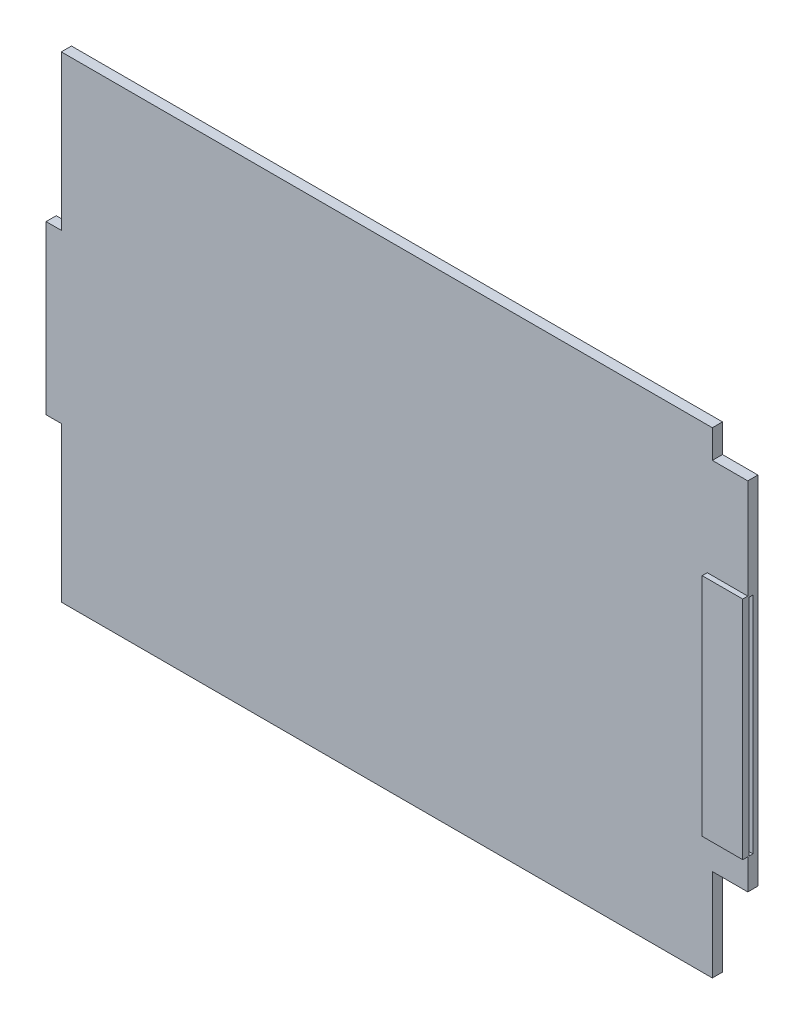
ISO-10303-21;
HEADER;
FILE_DESCRIPTION(('STEP AP214'),'2;1');
FILE_NAME('part.step','',(''),(''),'','','');
FILE_SCHEMA(('AUTOMOTIVE_DESIGN { 1 0 10303 214 1 1 1 1 }'));
ENDSEC;
DATA;
#1=APPLICATION_CONTEXT('core data for automotive mechanical design processes');
#2=APPLICATION_PROTOCOL_DEFINITION('international standard','automotive_design',2000,#1);
#3=PRODUCT_CONTEXT('',#1,'mechanical');
#4=PRODUCT('Part','Part','',(#3));
#5=PRODUCT_RELATED_PRODUCT_CATEGORY('part','',(#4));
#6=PRODUCT_DEFINITION_FORMATION('','',#4);
#7=PRODUCT_DEFINITION_CONTEXT('part definition',#1,'design');
#8=PRODUCT_DEFINITION('design','',#6,#7);
#9=PRODUCT_DEFINITION_SHAPE('','',#8);
#10=(LENGTH_UNIT() NAMED_UNIT(*) SI_UNIT(.MILLI.,.METRE.));
#11=(NAMED_UNIT(*) PLANE_ANGLE_UNIT() SI_UNIT($,.RADIAN.));
#12=(NAMED_UNIT(*) SI_UNIT($,.STERADIAN.) SOLID_ANGLE_UNIT());
#13=UNCERTAINTY_MEASURE_WITH_UNIT(LENGTH_MEASURE(1.E-05),#10,'distance_accuracy_value','');
#14=(GEOMETRIC_REPRESENTATION_CONTEXT(3) GLOBAL_UNCERTAINTY_ASSIGNED_CONTEXT((#13)) GLOBAL_UNIT_ASSIGNED_CONTEXT((#10,
#11,#12)) REPRESENTATION_CONTEXT('',''));
#15=CARTESIAN_POINT('',(0.,0.,0.));
#16=DIRECTION('',(0.,0.,1.));
#17=DIRECTION('',(1.,0.,0.));
#18=AXIS2_PLACEMENT_3D('',#15,#16,#17);
#19=CARTESIAN_POINT('',(-34.6,8.25220683677559,1.));
#20=DIRECTION('',(1.,0.,0.));
#21=DIRECTION('',(0.,0.,-1.));
#22=AXIS2_PLACEMENT_3D('',#19,#20,#21);
#23=PLANE('',#22);
#24=DIRECTION('',(0.,-1.,0.));
#25=VECTOR('',#24,1.);
#26=CARTESIAN_POINT('',(-34.6,8.25220683677559,0.));
#27=LINE('',#26,#25);
#28=CARTESIAN_POINT('',(-34.6,8.25220683677559,0.));
#29=VERTEX_POINT('',#28);
#30=CARTESIAN_POINT('',(-34.6,-8.24779316322441,0.));
#31=VERTEX_POINT('',#30);
#32=EDGE_CURVE('E168',#29,#31,#27,.T.);
#33=ORIENTED_EDGE('',*,*,#32,.T.);
#34=DIRECTION('',(0.,0.,-1.));
#35=VECTOR('',#34,1.);
#36=CARTESIAN_POINT('',(-34.6,-8.24779316322441,1.));
#37=LINE('',#36,#35);
#38=CARTESIAN_POINT('',(-34.6,-8.24779316322441,1.));
#39=VERTEX_POINT('',#38);
#40=EDGE_CURVE('E217',#39,#31,#37,.T.);
#41=ORIENTED_EDGE('',*,*,#40,.F.);
#42=DIRECTION('',(0.,-1.,0.));
#43=VECTOR('',#42,1.);
#44=CARTESIAN_POINT('',(-34.6,8.25220683677559,1.));
#45=LINE('',#44,#43);
#46=CARTESIAN_POINT('',(-34.6,8.25220683677559,1.));
#47=VERTEX_POINT('',#46);
#48=EDGE_CURVE('E192',#47,#39,#45,.T.);
#49=ORIENTED_EDGE('',*,*,#48,.F.);
#50=DIRECTION('',(0.,0.,-1.));
#51=VECTOR('',#50,1.);
#52=CARTESIAN_POINT('',(-34.6,8.25220683677559,1.));
#53=LINE('',#52,#51);
#54=EDGE_CURVE('E164',#47,#29,#53,.T.);
#55=ORIENTED_EDGE('',*,*,#54,.T.);
#56=EDGE_LOOP('',(#33,#41,#49,#55));
#57=FACE_BOUND('',#56,.T.);
#58=ADVANCED_FACE('F35',(#57),#23,.F.);
#59=CARTESIAN_POINT('',(-34.6,-8.24779316322441,1.));
#60=DIRECTION('',(0.,1.,0.));
#61=DIRECTION('',(-1.,0.,0.));
#62=AXIS2_PLACEMENT_3D('',#59,#60,#61);
#63=PLANE('',#62);
#64=DIRECTION('',(1.,0.,0.));
#65=VECTOR('',#64,1.);
#66=CARTESIAN_POINT('',(-34.6,-8.24779316322441,0.));
#67=LINE('',#66,#65);
#68=CARTESIAN_POINT('',(-33.0953892850898,-8.24779316322442,0.));
#69=VERTEX_POINT('',#68);
#70=EDGE_CURVE('E171',#31,#69,#67,.T.);
#71=ORIENTED_EDGE('',*,*,#70,.T.);
#72=DIRECTION('',(0.,0.,-1.));
#73=VECTOR('',#72,1.);
#74=CARTESIAN_POINT('',(-33.0953892850898,-8.24779316322442,1.));
#75=LINE('',#74,#73);
#76=CARTESIAN_POINT('',(-33.0953892850898,-8.24779316322442,1.));
#77=VERTEX_POINT('',#76);
#78=EDGE_CURVE('E214',#77,#69,#75,.T.);
#79=ORIENTED_EDGE('',*,*,#78,.F.);
#80=DIRECTION('',(1.,0.,0.));
#81=VECTOR('',#80,1.);
#82=CARTESIAN_POINT('',(-34.6,-8.24779316322441,1.));
#83=LINE('',#82,#81);
#84=EDGE_CURVE('E111',#39,#77,#83,.T.);
#85=ORIENTED_EDGE('',*,*,#84,.F.);
#86=ORIENTED_EDGE('',*,*,#40,.T.);
#87=EDGE_LOOP('',(#71,#79,#85,#86));
#88=FACE_BOUND('',#87,.T.);
#89=ADVANCED_FACE('F282',(#88),#63,.F.);
#90=CARTESIAN_POINT('',(-33.0953892850898,-8.24779316322442,1.));
#91=DIRECTION('',(1.,0.,0.));
#92=DIRECTION('',(0.,0.,-1.));
#93=AXIS2_PLACEMENT_3D('',#90,#91,#92);
#94=PLANE('',#93);
#95=DIRECTION('',(0.,-1.,0.));
#96=VECTOR('',#95,1.);
#97=CARTESIAN_POINT('',(-33.0953892850898,-8.24779316322442,0.));
#98=LINE('',#97,#96);
#99=CARTESIAN_POINT('',(-33.0953892850898,-23.4977931632244,0.));
#100=VERTEX_POINT('',#99);
#101=EDGE_CURVE('E174',#69,#100,#98,.T.);
#102=ORIENTED_EDGE('',*,*,#101,.T.);
#103=DIRECTION('',(0.,0.,-1.));
#104=VECTOR('',#103,1.);
#105=CARTESIAN_POINT('',(-33.0953892850898,-23.4977931632244,1.));
#106=LINE('',#105,#104);
#107=CARTESIAN_POINT('',(-33.0953892850898,-23.4977931632244,1.));
#108=VERTEX_POINT('',#107);
#109=EDGE_CURVE('E211',#108,#100,#106,.T.);
#110=ORIENTED_EDGE('',*,*,#109,.F.);
#111=DIRECTION('',(0.,-1.,0.));
#112=VECTOR('',#111,1.);
#113=CARTESIAN_POINT('',(-33.0953892850898,-8.24779316322442,1.));
#114=LINE('',#113,#112);
#115=EDGE_CURVE('E249',#77,#108,#114,.T.);
#116=ORIENTED_EDGE('',*,*,#115,.F.);
#117=ORIENTED_EDGE('',*,*,#78,.T.);
#118=EDGE_LOOP('',(#102,#110,#116,#117));
#119=FACE_BOUND('',#118,.T.);
#120=ADVANCED_FACE('F285',(#119),#94,.F.);
#121=CARTESIAN_POINT('',(-33.0953892850898,-23.4977931632244,1.));
#122=DIRECTION('',(0.,1.,0.));
#123=DIRECTION('',(0.,0.,1.));
#124=AXIS2_PLACEMENT_3D('',#121,#122,#123);
#125=PLANE('',#124);
#126=DIRECTION('',(1.,0.,0.));
#127=VECTOR('',#126,1.);
#128=CARTESIAN_POINT('',(-33.0953892850898,-23.4977931632244,0.));
#129=LINE('',#128,#127);
#130=CARTESIAN_POINT('',(31.1043201226953,-23.4977931632244,0.));
#131=VERTEX_POINT('',#130);
#132=EDGE_CURVE('E176',#100,#131,#129,.T.);
#133=ORIENTED_EDGE('',*,*,#132,.T.);
#134=DIRECTION('',(0.,0.,-1.));
#135=VECTOR('',#134,1.);
#136=CARTESIAN_POINT('',(31.1043201226953,-23.4977931632244,1.));
#137=LINE('',#136,#135);
#138=CARTESIAN_POINT('',(31.1043201226953,-23.4977931632244,1.));
#139=VERTEX_POINT('',#138);
#140=EDGE_CURVE('E208',#139,#131,#137,.T.);
#141=ORIENTED_EDGE('',*,*,#140,.F.);
#142=DIRECTION('',(1.,0.,0.));
#143=VECTOR('',#142,1.);
#144=CARTESIAN_POINT('',(-33.0953892850898,-23.4977931632244,1.));
#145=LINE('',#144,#143);
#146=EDGE_CURVE('E251',#108,#139,#145,.T.);
#147=ORIENTED_EDGE('',*,*,#146,.F.);
#148=ORIENTED_EDGE('',*,*,#109,.T.);
#149=EDGE_LOOP('',(#133,#141,#147,#148));
#150=FACE_BOUND('',#149,.T.);
#151=ADVANCED_FACE('F290',(#150),#125,.F.);
#152=CARTESIAN_POINT('',(31.1043201226953,-23.4977931632244,1.));
#153=DIRECTION('',(-1.,0.,0.));
#154=DIRECTION('',(0.,0.,1.));
#155=AXIS2_PLACEMENT_3D('',#152,#153,#154);
#156=PLANE('',#155);
#157=DIRECTION('',(0.,1.,0.));
#158=VECTOR('',#157,1.);
#159=CARTESIAN_POINT('',(31.1043201226953,-23.4977931632244,0.));
#160=LINE('',#159,#158);
#161=CARTESIAN_POINT('',(31.1043201226953,-14.402052139164,0.));
#162=VERTEX_POINT('',#161);
#163=EDGE_CURVE('E178',#131,#162,#160,.T.);
#164=ORIENTED_EDGE('',*,*,#163,.T.);
#165=DIRECTION('',(0.,0.,-1.));
#166=VECTOR('',#165,1.);
#167=CARTESIAN_POINT('',(31.1043201226953,-14.402052139164,1.));
#168=LINE('',#167,#166);
#169=CARTESIAN_POINT('',(31.1043201226953,-14.402052139164,1.));
#170=VERTEX_POINT('',#169);
#171=EDGE_CURVE('E205',#170,#162,#168,.T.);
#172=ORIENTED_EDGE('',*,*,#171,.F.);
#173=DIRECTION('',(0.,1.,0.));
#174=VECTOR('',#173,1.);
#175=CARTESIAN_POINT('',(31.1043201226953,-23.4977931632244,1.));
#176=LINE('',#175,#174);
#177=EDGE_CURVE('E253',#139,#170,#176,.T.);
#178=ORIENTED_EDGE('',*,*,#177,.F.);
#179=ORIENTED_EDGE('',*,*,#140,.T.);
#180=EDGE_LOOP('',(#164,#172,#178,#179));
#181=FACE_BOUND('',#180,.T.);
#182=ADVANCED_FACE('F296',(#181),#156,.F.);
#183=CARTESIAN_POINT('',(31.1043201226953,-14.402052139164,1.));
#184=DIRECTION('',(0.,1.,0.));
#185=DIRECTION('',(-1.,0.,0.));
#186=AXIS2_PLACEMENT_3D('',#183,#184,#185);
#187=PLANE('',#186);
#188=DIRECTION('',(1.,0.,0.));
#189=VECTOR('',#188,1.);
#190=CARTESIAN_POINT('',(31.1043201226953,-14.402052139164,0.));
#191=LINE('',#190,#189);
#192=CARTESIAN_POINT('',(34.6,-14.402052139164,0.));
#193=VERTEX_POINT('',#192);
#194=EDGE_CURVE('E180',#162,#193,#191,.T.);
#195=ORIENTED_EDGE('',*,*,#194,.T.);
#196=DIRECTION('',(0.,0.,-1.));
#197=VECTOR('',#196,1.);
#198=CARTESIAN_POINT('',(34.6,-14.402052139164,1.));
#199=LINE('',#198,#197);
#200=CARTESIAN_POINT('',(34.6,-14.402052139164,1.));
#201=VERTEX_POINT('',#200);
#202=EDGE_CURVE('E202',#201,#193,#199,.T.);
#203=ORIENTED_EDGE('',*,*,#202,.F.);
#204=DIRECTION('',(1.,0.,0.));
#205=VECTOR('',#204,1.);
#206=CARTESIAN_POINT('',(31.1043201226953,-14.402052139164,1.));
#207=LINE('',#206,#205);
#208=EDGE_CURVE('E255',#170,#201,#207,.T.);
#209=ORIENTED_EDGE('',*,*,#208,.F.);
#210=ORIENTED_EDGE('',*,*,#171,.T.);
#211=EDGE_LOOP('',(#195,#203,#209,#210));
#212=FACE_BOUND('',#211,.T.);
#213=ADVANCED_FACE('F300',(#212),#187,.F.);
#214=CARTESIAN_POINT('',(34.6,-14.402052139164,1.));
#215=DIRECTION('',(-1.,0.,0.));
#216=DIRECTION('',(0.,0.,1.));
#217=AXIS2_PLACEMENT_3D('',#214,#215,#216);
#218=PLANE('',#217);
#219=DIRECTION('',(0.,1.,0.));
#220=VECTOR('',#219,1.);
#221=CARTESIAN_POINT('',(34.6,-11.3978554015761,0.9));
#222=LINE('',#221,#220);
#223=CARTESIAN_POINT('',(34.6,-11.3978554015761,0.9));
#224=VERTEX_POINT('',#223);
#225=CARTESIAN_POINT('',(34.6,10.7025906810735,0.9));
#226=VERTEX_POINT('',#225);
#227=EDGE_CURVE('E369',#224,#226,#222,.T.);
#228=ORIENTED_EDGE('',*,*,#227,.T.);
#229=DIRECTION('',(0.,0.,1.));
#230=VECTOR('',#229,1.);
#231=CARTESIAN_POINT('',(34.6,10.7025906810735,0.5));
#232=LINE('',#231,#230);
#233=CARTESIAN_POINT('',(34.6,10.7025906810735,0.5));
#234=VERTEX_POINT('',#233);
#235=EDGE_CURVE('E229',#234,#226,#232,.T.);
#236=ORIENTED_EDGE('',*,*,#235,.F.);
#237=DIRECTION('',(0.,1.,0.));
#238=VECTOR('',#237,1.);
#239=CARTESIAN_POINT('',(34.6,10.7025906810735,0.5));
#240=LINE('',#239,#238);
#241=CARTESIAN_POINT('',(34.6,-11.3978554015761,0.5));
#242=VERTEX_POINT('',#241);
#243=EDGE_CURVE('E343',#242,#234,#240,.T.);
#244=ORIENTED_EDGE('',*,*,#243,.F.);
#245=DIRECTION('',(0.,0.,1.));
#246=VECTOR('',#245,1.);
#247=CARTESIAN_POINT('',(34.6,-11.3978554015761,0.5));
#248=LINE('',#247,#246);
#249=EDGE_CURVE('E172',#242,#224,#248,.T.);
#250=ORIENTED_EDGE('',*,*,#249,.T.);
#251=EDGE_LOOP('',(#228,#236,#244,#250));
#252=FACE_BOUND('',#251,.T.);
#253=DIRECTION('',(0.,1.,0.));
#254=VECTOR('',#253,1.);
#255=CARTESIAN_POINT('',(34.6,-14.402052139164,1.));
#256=LINE('',#255,#254);
#257=CARTESIAN_POINT('',(34.6,10.8649471333239,1.));
#258=VERTEX_POINT('',#257);
#259=CARTESIAN_POINT('',(34.6,20.7065211747211,1.));
#260=VERTEX_POINT('',#259);
#261=EDGE_CURVE('E257',#258,#260,#256,.T.);
#262=ORIENTED_EDGE('',*,*,#261,.F.);
#263=DIRECTION('',(0.,0.,1.));
#264=VECTOR('',#263,1.);
#265=CARTESIAN_POINT('',(34.6,10.8649471333239,0.9));
#266=LINE('',#265,#264);
#267=CARTESIAN_POINT('',(34.6,10.8649471333239,1.5));
#268=VERTEX_POINT('',#267);
#269=EDGE_CURVE('E360',#258,#268,#266,.T.);
#270=ORIENTED_EDGE('',*,*,#269,.T.);
#271=DIRECTION('',(0.,1.,0.));
#272=VECTOR('',#271,1.);
#273=CARTESIAN_POINT('',(34.6,-11.3978554015761,1.5));
#274=LINE('',#273,#272);
#275=CARTESIAN_POINT('',(34.6,-11.3978554015761,1.5));
#276=VERTEX_POINT('',#275);
#277=EDGE_CURVE('E380',#276,#268,#274,.T.);
#278=ORIENTED_EDGE('',*,*,#277,.F.);
#279=DIRECTION('',(0.,0.,1.));
#280=VECTOR('',#279,1.);
#281=CARTESIAN_POINT('',(34.6,-11.3978554015761,0.9));
#282=LINE('',#281,#280);
#283=CARTESIAN_POINT('',(34.6,-11.3978554015761,1.));
#284=VERTEX_POINT('',#283);
#285=EDGE_CURVE('E309',#284,#276,#282,.T.);
#286=ORIENTED_EDGE('',*,*,#285,.F.);
#287=EDGE_CURVE('E258',#201,#284,#256,.T.);
#288=ORIENTED_EDGE('',*,*,#287,.F.);
#289=ORIENTED_EDGE('',*,*,#202,.T.);
#290=DIRECTION('',(0.,1.,0.));
#291=VECTOR('',#290,1.);
#292=CARTESIAN_POINT('',(34.6,-14.402052139164,0.));
#293=LINE('',#292,#291);
#294=CARTESIAN_POINT('',(34.6,20.7065211747211,0.));
#295=VERTEX_POINT('',#294);
#296=EDGE_CURVE('E182',#193,#295,#293,.T.);
#297=ORIENTED_EDGE('',*,*,#296,.T.);
#298=DIRECTION('',(0.,0.,-1.));
#299=VECTOR('',#298,1.);
#300=CARTESIAN_POINT('',(34.6,20.7065211747211,1.));
#301=LINE('',#300,#299);
#302=EDGE_CURVE('E199',#260,#295,#301,.T.);
#303=ORIENTED_EDGE('',*,*,#302,.F.);
#304=EDGE_LOOP('',(#262,#270,#278,#286,#288,#289,#297,#303));
#305=FACE_BOUND('',#304,.T.);
#306=ADVANCED_FACE('F305',(#252,#305),#218,.F.);
#307=CARTESIAN_POINT('',(34.6,20.7065211747211,1.));
#308=DIRECTION('',(0.,-1.,0.));
#309=DIRECTION('',(0.,0.,-1.));
#310=AXIS2_PLACEMENT_3D('',#307,#308,#309);
#311=PLANE('',#310);
#312=DIRECTION('',(-1.,0.,0.));
#313=VECTOR('',#312,1.);
#314=CARTESIAN_POINT('',(34.6,20.7065211747211,0.));
#315=LINE('',#314,#313);
#316=CARTESIAN_POINT('',(31.1043201226952,20.7065211747211,0.));
#317=VERTEX_POINT('',#316);
#318=EDGE_CURVE('E184',#295,#317,#315,.T.);
#319=ORIENTED_EDGE('',*,*,#318,.T.);
#320=DIRECTION('',(0.,0.,-1.));
#321=VECTOR('',#320,1.);
#322=CARTESIAN_POINT('',(31.1043201226952,20.7065211747211,1.));
#323=LINE('',#322,#321);
#324=CARTESIAN_POINT('',(31.1043201226952,20.7065211747211,1.));
#325=VERTEX_POINT('',#324);
#326=EDGE_CURVE('E196',#325,#317,#323,.T.);
#327=ORIENTED_EDGE('',*,*,#326,.F.);
#328=DIRECTION('',(-1.,0.,0.));
#329=VECTOR('',#328,1.);
#330=CARTESIAN_POINT('',(34.6,20.7065211747211,1.));
#331=LINE('',#330,#329);
#332=EDGE_CURVE('E261',#260,#325,#331,.T.);
#333=ORIENTED_EDGE('',*,*,#332,.F.);
#334=ORIENTED_EDGE('',*,*,#302,.T.);
#335=EDGE_LOOP('',(#319,#327,#333,#334));
#336=FACE_BOUND('',#335,.T.);
#337=ADVANCED_FACE('F268',(#336),#311,.F.);
#338=CARTESIAN_POINT('',(31.1043201226952,20.7065211747211,1.));
#339=DIRECTION('',(-1.,0.,0.));
#340=DIRECTION('',(0.,0.,1.));
#341=AXIS2_PLACEMENT_3D('',#338,#339,#340);
#342=PLANE('',#341);
#343=DIRECTION('',(0.,1.,0.));
#344=VECTOR('',#343,1.);
#345=CARTESIAN_POINT('',(31.1043201226952,20.7065211747211,0.));
#346=LINE('',#345,#344);
#347=CARTESIAN_POINT('',(31.1043201226952,23.4977931632244,0.));
#348=VERTEX_POINT('',#347);
#349=EDGE_CURVE('E186',#317,#348,#346,.T.);
#350=ORIENTED_EDGE('',*,*,#349,.T.);
#351=DIRECTION('',(0.,0.,-1.));
#352=VECTOR('',#351,1.);
#353=CARTESIAN_POINT('',(31.1043201226952,23.4977931632244,1.));
#354=LINE('',#353,#352);
#355=CARTESIAN_POINT('',(31.1043201226952,23.4977931632244,1.));
#356=VERTEX_POINT('',#355);
#357=EDGE_CURVE('E159',#356,#348,#354,.T.);
#358=ORIENTED_EDGE('',*,*,#357,.F.);
#359=DIRECTION('',(0.,1.,0.));
#360=VECTOR('',#359,1.);
#361=CARTESIAN_POINT('',(31.1043201226952,20.7065211747211,1.));
#362=LINE('',#361,#360);
#363=EDGE_CURVE('E146',#325,#356,#362,.T.);
#364=ORIENTED_EDGE('',*,*,#363,.F.);
#365=ORIENTED_EDGE('',*,*,#326,.T.);
#366=EDGE_LOOP('',(#350,#358,#364,#365));
#367=FACE_BOUND('',#366,.T.);
#368=ADVANCED_FACE('F272',(#367),#342,.F.);
#369=CARTESIAN_POINT('',(31.1043201226952,23.4977931632244,1.));
#370=DIRECTION('',(0.,-1.,0.));
#371=DIRECTION('',(0.,0.,-1.));
#372=AXIS2_PLACEMENT_3D('',#369,#370,#371);
#373=PLANE('',#372);
#374=DIRECTION('',(-1.,0.,0.));
#375=VECTOR('',#374,1.);
#376=CARTESIAN_POINT('',(31.1043201226952,23.4977931632244,0.));
#377=LINE('',#376,#375);
#378=CARTESIAN_POINT('',(-33.0953892850898,23.4977931632244,0.));
#379=VERTEX_POINT('',#378);
#380=EDGE_CURVE('E155',#348,#379,#377,.T.);
#381=ORIENTED_EDGE('',*,*,#380,.T.);
#382=DIRECTION('',(0.,0.,-1.));
#383=VECTOR('',#382,1.);
#384=CARTESIAN_POINT('',(-33.0953892850898,23.4977931632244,1.));
#385=LINE('',#384,#383);
#386=CARTESIAN_POINT('',(-33.0953892850898,23.4977931632244,1.));
#387=VERTEX_POINT('',#386);
#388=EDGE_CURVE('E152',#387,#379,#385,.T.);
#389=ORIENTED_EDGE('',*,*,#388,.F.);
#390=DIRECTION('',(-1.,0.,0.));
#391=VECTOR('',#390,1.);
#392=CARTESIAN_POINT('',(31.1043201226952,23.4977931632244,1.));
#393=LINE('',#392,#391);
#394=EDGE_CURVE('E138',#356,#387,#393,.T.);
#395=ORIENTED_EDGE('',*,*,#394,.F.);
#396=ORIENTED_EDGE('',*,*,#357,.T.);
#397=EDGE_LOOP('',(#381,#389,#395,#396));
#398=FACE_BOUND('',#397,.T.);
#399=ADVANCED_FACE('F153',(#398),#373,.F.);
#400=CARTESIAN_POINT('',(-33.0953892850898,23.4977931632244,1.));
#401=DIRECTION('',(1.,0.,0.));
#402=DIRECTION('',(0.,0.,-1.));
#403=AXIS2_PLACEMENT_3D('',#400,#401,#402);
#404=PLANE('',#403);
#405=DIRECTION('',(0.,-1.,0.));
#406=VECTOR('',#405,1.);
#407=CARTESIAN_POINT('',(-33.0953892850898,23.4977931632244,0.));
#408=LINE('',#407,#406);
#409=CARTESIAN_POINT('',(-33.0953892850898,8.25220683677558,0.));
#410=VERTEX_POINT('',#409);
#411=EDGE_CURVE('E189',#379,#410,#408,.T.);
#412=ORIENTED_EDGE('',*,*,#411,.T.);
#413=DIRECTION('',(0.,0.,-1.));
#414=VECTOR('',#413,1.);
#415=CARTESIAN_POINT('',(-33.0953892850898,8.25220683677558,1.));
#416=LINE('',#415,#414);
#417=CARTESIAN_POINT('',(-33.0953892850898,8.25220683677558,1.));
#418=VERTEX_POINT('',#417);
#419=EDGE_CURVE('E160',#418,#410,#416,.T.);
#420=ORIENTED_EDGE('',*,*,#419,.F.);
#421=DIRECTION('',(0.,-1.,0.));
#422=VECTOR('',#421,1.);
#423=CARTESIAN_POINT('',(-33.0953892850898,23.4977931632244,1.));
#424=LINE('',#423,#422);
#425=EDGE_CURVE('E143',#387,#418,#424,.T.);
#426=ORIENTED_EDGE('',*,*,#425,.F.);
#427=ORIENTED_EDGE('',*,*,#388,.T.);
#428=EDGE_LOOP('',(#412,#420,#426,#427));
#429=FACE_BOUND('',#428,.T.);
#430=ADVANCED_FACE('F162',(#429),#404,.F.);
#431=CARTESIAN_POINT('',(-34.5108366178629,8.25220683677559,1.));
#432=DIRECTION('',(0.,-1.,0.));
#433=DIRECTION('',(0.,0.,-1.));
#434=AXIS2_PLACEMENT_3D('',#431,#432,#433);
#435=PLANE('',#434);
#436=DIRECTION('',(-1.,0.,0.));
#437=VECTOR('',#436,1.);
#438=CARTESIAN_POINT('',(-34.5108366178629,8.25220683677559,0.));
#439=LINE('',#438,#437);
#440=EDGE_CURVE('E102',#410,#29,#439,.T.);
#441=ORIENTED_EDGE('',*,*,#440,.T.);
#442=ORIENTED_EDGE('',*,*,#54,.F.);
#443=DIRECTION('',(-1.,0.,0.));
#444=VECTOR('',#443,1.);
#445=CARTESIAN_POINT('',(-33.0953892850898,8.25220683677558,1.));
#446=LINE('',#445,#444);
#447=EDGE_CURVE('E58',#418,#47,#446,.T.);
#448=ORIENTED_EDGE('',*,*,#447,.F.);
#449=ORIENTED_EDGE('',*,*,#419,.T.);
#450=EDGE_LOOP('',(#441,#442,#448,#449));
#451=FACE_BOUND('',#450,.T.);
#452=ADVANCED_FACE('F276',(#451),#435,.F.);
#453=CARTESIAN_POINT('',(0.,0.,1.));
#454=DIRECTION('',(0.,0.,1.));
#455=DIRECTION('',(1.,0.,0.));
#456=AXIS2_PLACEMENT_3D('',#453,#454,#455);
#457=PLANE('',#456);
#458=DIRECTION('',(0.,-1.,0.));
#459=VECTOR('',#458,1.);
#460=CARTESIAN_POINT('',(30.6,10.7025906810735,1.));
#461=LINE('',#460,#459);
#462=CARTESIAN_POINT('',(30.6,10.8649471333239,1.));
#463=VERTEX_POINT('',#462);
#464=CARTESIAN_POINT('',(30.6,-11.3978554015761,1.));
#465=VERTEX_POINT('',#464);
#466=EDGE_CURVE('E348',#463,#465,#461,.T.);
#467=ORIENTED_EDGE('',*,*,#466,.F.);
#468=DIRECTION('',(-1.,0.,0.));
#469=VECTOR('',#468,1.);
#470=CARTESIAN_POINT('',(0.,10.8649471333239,1.));
#471=LINE('',#470,#469);
#472=EDGE_CURVE('E11',#258,#463,#471,.T.);
#473=ORIENTED_EDGE('',*,*,#472,.F.);
#474=ORIENTED_EDGE('',*,*,#261,.T.);
#475=ORIENTED_EDGE('',*,*,#332,.T.);
#476=ORIENTED_EDGE('',*,*,#363,.T.);
#477=ORIENTED_EDGE('',*,*,#394,.T.);
#478=ORIENTED_EDGE('',*,*,#425,.T.);
#479=ORIENTED_EDGE('',*,*,#447,.T.);
#480=ORIENTED_EDGE('',*,*,#48,.T.);
#481=ORIENTED_EDGE('',*,*,#84,.T.);
#482=ORIENTED_EDGE('',*,*,#115,.T.);
#483=ORIENTED_EDGE('',*,*,#146,.T.);
#484=ORIENTED_EDGE('',*,*,#177,.T.);
#485=ORIENTED_EDGE('',*,*,#208,.T.);
#486=ORIENTED_EDGE('',*,*,#287,.T.);
#487=DIRECTION('',(1.,0.,0.));
#488=VECTOR('',#487,1.);
#489=CARTESIAN_POINT('',(34.6,-11.3978554015761,1.));
#490=LINE('',#489,#488);
#491=EDGE_CURVE('E313',#465,#284,#490,.T.);
#492=ORIENTED_EDGE('',*,*,#491,.F.);
#493=EDGE_LOOP('',(#467,#473,#474,#475,#476,#477,#478,#479,#480,#481,#482,#483,#484,#485,#486,#492));
#494=FACE_BOUND('',#493,.T.);
#495=ADVANCED_FACE('F141',(#494),#457,.T.);
#496=CARTESIAN_POINT('',(0.,0.,0.));
#497=DIRECTION('',(0.,0.,1.));
#498=DIRECTION('',(1.,0.,0.));
#499=AXIS2_PLACEMENT_3D('',#496,#497,#498);
#500=PLANE('',#499);
#501=ORIENTED_EDGE('',*,*,#32,.F.);
#502=ORIENTED_EDGE('',*,*,#440,.F.);
#503=ORIENTED_EDGE('',*,*,#411,.F.);
#504=ORIENTED_EDGE('',*,*,#380,.F.);
#505=ORIENTED_EDGE('',*,*,#349,.F.);
#506=ORIENTED_EDGE('',*,*,#318,.F.);
#507=ORIENTED_EDGE('',*,*,#296,.F.);
#508=ORIENTED_EDGE('',*,*,#194,.F.);
#509=ORIENTED_EDGE('',*,*,#163,.F.);
#510=ORIENTED_EDGE('',*,*,#132,.F.);
#511=ORIENTED_EDGE('',*,*,#101,.F.);
#512=ORIENTED_EDGE('',*,*,#70,.F.);
#513=EDGE_LOOP('',(#501,#502,#503,#504,#505,#506,#507,#508,#509,#510,#511,#512));
#514=FACE_BOUND('',#513,.T.);
#515=ADVANCED_FACE('F275',(#514),#500,.F.);
#516=CARTESIAN_POINT('',(34.6,-11.3978554015761,0.5));
#517=DIRECTION('',(0.,-1.,0.));
#518=DIRECTION('',(0.,0.,-1.));
#519=AXIS2_PLACEMENT_3D('',#516,#517,#518);
#520=PLANE('',#519);
#521=DIRECTION('',(0.,0.,1.));
#522=VECTOR('',#521,1.);
#523=CARTESIAN_POINT('',(30.6,-11.3978554015761,0.5));
#524=LINE('',#523,#522);
#525=CARTESIAN_POINT('',(30.6,-11.3978554015761,0.5));
#526=VERTEX_POINT('',#525);
#527=CARTESIAN_POINT('',(30.6,-11.3978554015761,0.9));
#528=VERTEX_POINT('',#527);
#529=EDGE_CURVE('E240',#526,#528,#524,.T.);
#530=ORIENTED_EDGE('',*,*,#529,.T.);
#531=DIRECTION('',(1.,0.,0.));
#532=VECTOR('',#531,1.);
#533=CARTESIAN_POINT('',(30.6,-11.3978554015761,0.9));
#534=LINE('',#533,#532);
#535=EDGE_CURVE('E337',#528,#224,#534,.T.);
#536=ORIENTED_EDGE('',*,*,#535,.T.);
#537=ORIENTED_EDGE('',*,*,#249,.F.);
#538=DIRECTION('',(1.,0.,0.));
#539=VECTOR('',#538,1.);
#540=CARTESIAN_POINT('',(34.6,-11.3978554015761,0.5));
#541=LINE('',#540,#539);
#542=EDGE_CURVE('E243',#526,#242,#541,.T.);
#543=ORIENTED_EDGE('',*,*,#542,.F.);
#544=EDGE_LOOP('',(#530,#536,#537,#543));
#545=FACE_BOUND('',#544,.T.);
#546=ADVANCED_FACE('F335',(#545),#520,.F.);
#547=CARTESIAN_POINT('',(30.6,10.7025906810735,0.5));
#548=DIRECTION('',(-1.,0.,0.));
#549=DIRECTION('',(0.,0.,1.));
#550=AXIS2_PLACEMENT_3D('',#547,#548,#549);
#551=PLANE('',#550);
#552=DIRECTION('',(0.,0.,1.));
#553=VECTOR('',#552,1.);
#554=CARTESIAN_POINT('',(30.6,10.7025906810735,0.5));
#555=LINE('',#554,#553);
#556=CARTESIAN_POINT('',(30.6,10.7025906810735,0.5));
#557=VERTEX_POINT('',#556);
#558=CARTESIAN_POINT('',(30.6,10.7025906810735,0.9));
#559=VERTEX_POINT('',#558);
#560=EDGE_CURVE('E225',#557,#559,#555,.T.);
#561=ORIENTED_EDGE('',*,*,#560,.T.);
#562=DIRECTION('',(0.,-1.,0.));
#563=VECTOR('',#562,1.);
#564=CARTESIAN_POINT('',(30.6,-11.3978554015761,0.9));
#565=LINE('',#564,#563);
#566=EDGE_CURVE('E49',#559,#528,#565,.T.);
#567=ORIENTED_EDGE('',*,*,#566,.T.);
#568=ORIENTED_EDGE('',*,*,#529,.F.);
#569=DIRECTION('',(0.,-1.,0.));
#570=VECTOR('',#569,1.);
#571=CARTESIAN_POINT('',(30.6,10.7025906810735,0.5));
#572=LINE('',#571,#570);
#573=EDGE_CURVE('E238',#557,#526,#572,.T.);
#574=ORIENTED_EDGE('',*,*,#573,.F.);
#575=EDGE_LOOP('',(#561,#567,#568,#574));
#576=FACE_BOUND('',#575,.T.);
#577=ADVANCED_FACE('F233',(#576),#551,.F.);
#578=CARTESIAN_POINT('',(34.6,10.7025906810735,0.5));
#579=DIRECTION('',(0.,1.,0.));
#580=DIRECTION('',(0.,0.,1.));
#581=AXIS2_PLACEMENT_3D('',#578,#579,#580);
#582=PLANE('',#581);
#583=ORIENTED_EDGE('',*,*,#235,.T.);
#584=DIRECTION('',(-1.,0.,0.));
#585=VECTOR('',#584,1.);
#586=CARTESIAN_POINT('',(34.6,10.7025906810735,0.9));
#587=LINE('',#586,#585);
#588=EDGE_CURVE('E42',#226,#559,#587,.T.);
#589=ORIENTED_EDGE('',*,*,#588,.T.);
#590=ORIENTED_EDGE('',*,*,#560,.F.);
#591=DIRECTION('',(-1.,0.,0.));
#592=VECTOR('',#591,1.);
#593=CARTESIAN_POINT('',(34.6,10.7025906810735,0.5));
#594=LINE('',#593,#592);
#595=EDGE_CURVE('E345',#234,#557,#594,.T.);
#596=ORIENTED_EDGE('',*,*,#595,.F.);
#597=EDGE_LOOP('',(#583,#589,#590,#596));
#598=FACE_BOUND('',#597,.T.);
#599=ADVANCED_FACE('F222',(#598),#582,.F.);
#600=CARTESIAN_POINT('',(0.,0.,0.5));
#601=DIRECTION('',(0.,0.,-1.));
#602=DIRECTION('',(-1.,0.,0.));
#603=AXIS2_PLACEMENT_3D('',#600,#601,#602);
#604=PLANE('',#603);
#605=ORIENTED_EDGE('',*,*,#243,.T.);
#606=ORIENTED_EDGE('',*,*,#595,.T.);
#607=ORIENTED_EDGE('',*,*,#573,.T.);
#608=ORIENTED_EDGE('',*,*,#542,.T.);
#609=EDGE_LOOP('',(#605,#606,#607,#608));
#610=FACE_BOUND('',#609,.T.);
#611=ADVANCED_FACE('F342',(#610),#604,.F.);
#612=CARTESIAN_POINT('',(0.,0.,0.9));
#613=DIRECTION('',(0.,0.,-1.));
#614=DIRECTION('',(-1.,0.,0.));
#615=AXIS2_PLACEMENT_3D('',#612,#613,#614);
#616=PLANE('',#615);
#617=ORIENTED_EDGE('',*,*,#588,.F.);
#618=ORIENTED_EDGE('',*,*,#227,.F.);
#619=ORIENTED_EDGE('',*,*,#535,.F.);
#620=ORIENTED_EDGE('',*,*,#566,.F.);
#621=EDGE_LOOP('',(#617,#618,#619,#620));
#622=FACE_BOUND('',#621,.T.);
#623=ADVANCED_FACE('F397',(#622),#616,.T.);
#624=CARTESIAN_POINT('',(30.6,-11.3978554015761,0.9));
#625=DIRECTION('',(-1.,0.,0.));
#626=DIRECTION('',(0.,0.,1.));
#627=AXIS2_PLACEMENT_3D('',#624,#625,#626);
#628=PLANE('',#627);
#629=DIRECTION('',(0.,0.,1.));
#630=VECTOR('',#629,1.);
#631=CARTESIAN_POINT('',(30.6,10.8649471333239,0.9));
#632=LINE('',#631,#630);
#633=CARTESIAN_POINT('',(30.6,10.8649471333239,1.5));
#634=VERTEX_POINT('',#633);
#635=EDGE_CURVE('E355',#463,#634,#632,.T.);
#636=ORIENTED_EDGE('',*,*,#635,.F.);
#637=ORIENTED_EDGE('',*,*,#466,.T.);
#638=DIRECTION('',(0.,0.,1.));
#639=VECTOR('',#638,1.);
#640=CARTESIAN_POINT('',(30.6,-11.3978554015761,0.9));
#641=LINE('',#640,#639);
#642=CARTESIAN_POINT('',(30.6,-11.3978554015761,1.5));
#643=VERTEX_POINT('',#642);
#644=EDGE_CURVE('E351',#465,#643,#641,.T.);
#645=ORIENTED_EDGE('',*,*,#644,.T.);
#646=DIRECTION('',(0.,-1.,0.));
#647=VECTOR('',#646,1.);
#648=CARTESIAN_POINT('',(30.6,-11.3978554015761,1.5));
#649=LINE('',#648,#647);
#650=EDGE_CURVE('E385',#634,#643,#649,.T.);
#651=ORIENTED_EDGE('',*,*,#650,.F.);
#652=EDGE_LOOP('',(#636,#637,#645,#651));
#653=FACE_BOUND('',#652,.T.);
#654=ADVANCED_FACE('F390',(#653),#628,.T.);
#655=CARTESIAN_POINT('',(30.6,10.8649471333239,0.9));
#656=DIRECTION('',(0.,1.,0.));
#657=DIRECTION('',(0.,0.,1.));
#658=AXIS2_PLACEMENT_3D('',#655,#656,#657);
#659=PLANE('',#658);
#660=ORIENTED_EDGE('',*,*,#269,.F.);
#661=ORIENTED_EDGE('',*,*,#472,.T.);
#662=ORIENTED_EDGE('',*,*,#635,.T.);
#663=DIRECTION('',(-1.,0.,0.));
#664=VECTOR('',#663,1.);
#665=CARTESIAN_POINT('',(30.6,10.8649471333239,1.5));
#666=LINE('',#665,#664);
#667=EDGE_CURVE('E376',#268,#634,#666,.T.);
#668=ORIENTED_EDGE('',*,*,#667,.F.);
#669=EDGE_LOOP('',(#660,#661,#662,#668));
#670=FACE_BOUND('',#669,.T.);
#671=ADVANCED_FACE('F404',(#670),#659,.T.);
#672=CARTESIAN_POINT('',(30.6,-11.3978554015761,0.9));
#673=DIRECTION('',(0.,-1.,0.));
#674=DIRECTION('',(0.,0.,-1.));
#675=AXIS2_PLACEMENT_3D('',#672,#673,#674);
#676=PLANE('',#675);
#677=ORIENTED_EDGE('',*,*,#644,.F.);
#678=ORIENTED_EDGE('',*,*,#491,.T.);
#679=ORIENTED_EDGE('',*,*,#285,.T.);
#680=DIRECTION('',(1.,0.,0.));
#681=VECTOR('',#680,1.);
#682=CARTESIAN_POINT('',(30.6,-11.3978554015761,1.5));
#683=LINE('',#682,#681);
#684=EDGE_CURVE('E383',#643,#276,#683,.T.);
#685=ORIENTED_EDGE('',*,*,#684,.F.);
#686=EDGE_LOOP('',(#677,#678,#679,#685));
#687=FACE_BOUND('',#686,.T.);
#688=ADVANCED_FACE('F446',(#687),#676,.T.);
#689=CARTESIAN_POINT('',(0.,0.,1.5));
#690=DIRECTION('',(0.,0.,-1.));
#691=DIRECTION('',(-1.,0.,0.));
#692=AXIS2_PLACEMENT_3D('',#689,#690,#691);
#693=PLANE('',#692);
#694=ORIENTED_EDGE('',*,*,#650,.T.);
#695=ORIENTED_EDGE('',*,*,#684,.T.);
#696=ORIENTED_EDGE('',*,*,#277,.T.);
#697=ORIENTED_EDGE('',*,*,#667,.T.);
#698=EDGE_LOOP('',(#694,#695,#696,#697));
#699=FACE_BOUND('',#698,.T.);
#700=ADVANCED_FACE('F388',(#699),#693,.F.);
#701=CLOSED_SHELL('',(#58,#89,#120,#151,#182,#213,#306,#337,#368,#399,#430,#452,#495,#515,#546,
#577,#599,#611,#623,#654,#671,#688,#700));
#702=MANIFOLD_SOLID_BREP('B2',#701);
#703=ADVANCED_BREP_SHAPE_REPRESENTATION('',(#18,#702),#14);
#704=SHAPE_DEFINITION_REPRESENTATION(#9,#703);
ENDSEC;
END-ISO-10303-21;
